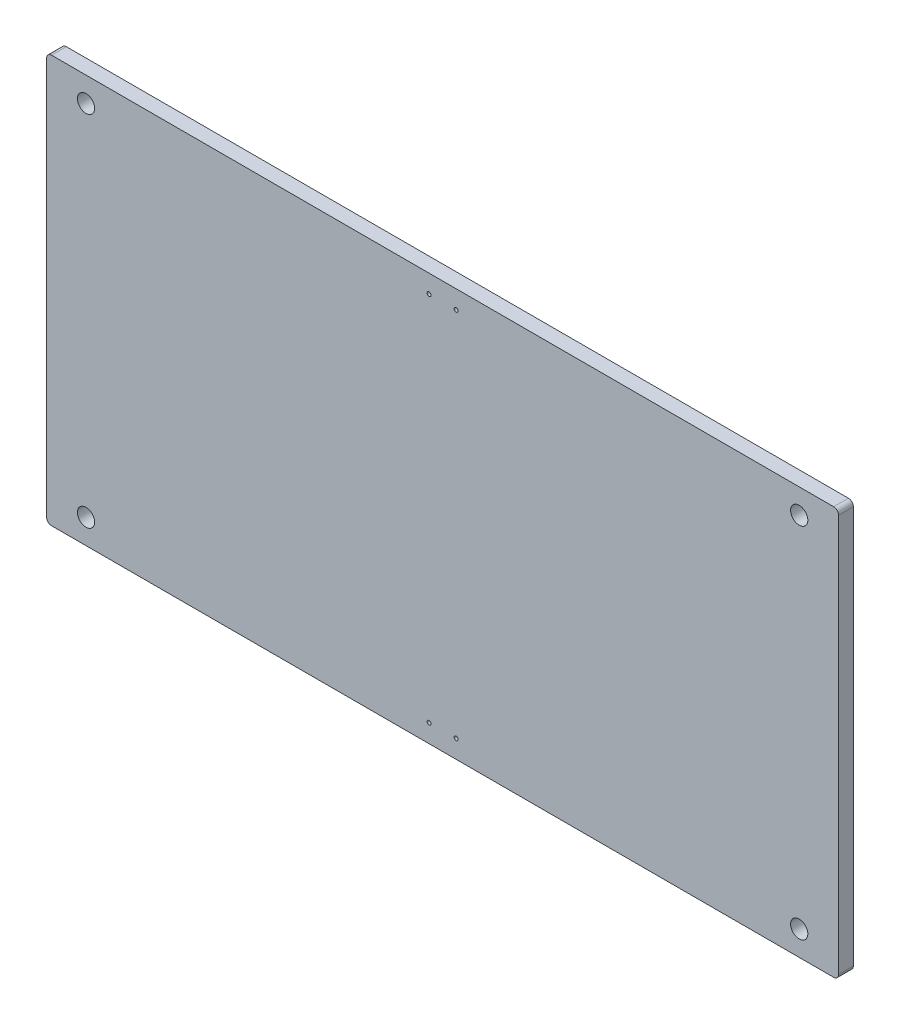
ISO-10303-21;
HEADER;
FILE_DESCRIPTION(('STEP AP214'),'2;1');
FILE_NAME('part.step','',(''),(''),'','','');
FILE_SCHEMA(('AUTOMOTIVE_DESIGN { 1 0 10303 214 1 1 1 1 }'));
ENDSEC;
DATA;
#1=APPLICATION_CONTEXT('core data for automotive mechanical design processes');
#2=APPLICATION_PROTOCOL_DEFINITION('international standard','automotive_design',2000,#1);
#3=PRODUCT_CONTEXT('',#1,'mechanical');
#4=PRODUCT('Part','Part','',(#3));
#5=PRODUCT_RELATED_PRODUCT_CATEGORY('part','',(#4));
#6=PRODUCT_DEFINITION_FORMATION('','',#4);
#7=PRODUCT_DEFINITION_CONTEXT('part definition',#1,'design');
#8=PRODUCT_DEFINITION('design','',#6,#7);
#9=PRODUCT_DEFINITION_SHAPE('','',#8);
#10=(LENGTH_UNIT() NAMED_UNIT(*) SI_UNIT(.MILLI.,.METRE.));
#11=(NAMED_UNIT(*) PLANE_ANGLE_UNIT() SI_UNIT($,.RADIAN.));
#12=(NAMED_UNIT(*) SI_UNIT($,.STERADIAN.) SOLID_ANGLE_UNIT());
#13=UNCERTAINTY_MEASURE_WITH_UNIT(LENGTH_MEASURE(1.E-05),#10,'distance_accuracy_value','');
#14=(GEOMETRIC_REPRESENTATION_CONTEXT(3) GLOBAL_UNCERTAINTY_ASSIGNED_CONTEXT((#13)) GLOBAL_UNIT_ASSIGNED_CONTEXT((#10,
#11,#12)) REPRESENTATION_CONTEXT('',''));
#15=CARTESIAN_POINT('',(0.,0.,0.));
#16=DIRECTION('',(0.,0.,1.));
#17=DIRECTION('',(1.,0.,0.));
#18=AXIS2_PLACEMENT_3D('',#15,#16,#17);
#19=CARTESIAN_POINT('',(431.087540983607,431.475409836066,6.));
#20=DIRECTION('',(1.,0.,0.));
#21=DIRECTION('',(0.,0.,-1.));
#22=AXIS2_PLACEMENT_3D('',#19,#20,#21);
#23=PLANE('',#22);
#24=DIRECTION('',(0.,-1.,0.));
#25=VECTOR('',#24,1.);
#26=CARTESIAN_POINT('',(431.087540983607,431.475409836066,0.));
#27=LINE('',#26,#25);
#28=CARTESIAN_POINT('',(431.087540983607,429.475409836066,0.));
#29=VERTEX_POINT('',#28);
#30=CARTESIAN_POINT('',(431.087540983607,267.865409836066,0.));
#31=VERTEX_POINT('',#30);
#32=EDGE_CURVE('E173',#29,#31,#27,.T.);
#33=ORIENTED_EDGE('',*,*,#32,.T.);
#34=DIRECTION('',(0.,0.,-1.));
#35=VECTOR('',#34,1.);
#36=CARTESIAN_POINT('',(431.087540983607,267.865409836066,6.));
#37=LINE('',#36,#35);
#38=CARTESIAN_POINT('',(431.087540983607,267.865409836066,6.));
#39=VERTEX_POINT('',#38);
#40=EDGE_CURVE('E11',#31,#39,#37,.F.);
#41=ORIENTED_EDGE('',*,*,#40,.T.);
#42=DIRECTION('',(0.,-1.,0.));
#43=VECTOR('',#42,1.);
#44=CARTESIAN_POINT('',(431.087540983607,431.475409836066,6.));
#45=LINE('',#44,#43);
#46=CARTESIAN_POINT('',(431.087540983607,429.475409836066,6.));
#47=VERTEX_POINT('',#46);
#48=EDGE_CURVE('E124',#47,#39,#45,.T.);
#49=ORIENTED_EDGE('',*,*,#48,.F.);
#50=DIRECTION('',(0.,0.,-1.));
#51=VECTOR('',#50,1.);
#52=CARTESIAN_POINT('',(431.087540983607,429.475409836066,6.));
#53=LINE('',#52,#51);
#54=EDGE_CURVE('E40',#47,#29,#53,.T.);
#55=ORIENTED_EDGE('',*,*,#54,.T.);
#56=EDGE_LOOP('',(#33,#41,#49,#55));
#57=FACE_BOUND('',#56,.T.);
#58=ADVANCED_FACE('F32',(#57),#23,.F.);
#59=CARTESIAN_POINT('',(431.087540983607,265.865409836066,6.));
#60=DIRECTION('',(0.,1.,0.));
#61=DIRECTION('',(0.,0.,1.));
#62=AXIS2_PLACEMENT_3D('',#59,#60,#61);
#63=PLANE('',#62);
#64=DIRECTION('',(1.,0.,0.));
#65=VECTOR('',#64,1.);
#66=CARTESIAN_POINT('',(431.087540983607,265.865409836066,0.));
#67=LINE('',#66,#65);
#68=CARTESIAN_POINT('',(433.087540983607,265.865409836066,0.));
#69=VERTEX_POINT('',#68);
#70=CARTESIAN_POINT('',(750.897540983607,265.865409836066,0.));
#71=VERTEX_POINT('',#70);
#72=EDGE_CURVE('E129',#69,#71,#67,.T.);
#73=ORIENTED_EDGE('',*,*,#72,.T.);
#74=DIRECTION('',(0.,0.,-1.));
#75=VECTOR('',#74,1.);
#76=CARTESIAN_POINT('',(750.897540983607,265.865409836066,6.));
#77=LINE('',#76,#75);
#78=CARTESIAN_POINT('',(750.897540983607,265.865409836066,6.));
#79=VERTEX_POINT('',#78);
#80=EDGE_CURVE('E47',#71,#79,#77,.F.);
#81=ORIENTED_EDGE('',*,*,#80,.T.);
#82=DIRECTION('',(1.,0.,0.));
#83=VECTOR('',#82,1.);
#84=CARTESIAN_POINT('',(431.087540983607,265.865409836066,6.));
#85=LINE('',#84,#83);
#86=CARTESIAN_POINT('',(433.087540983607,265.865409836066,6.));
#87=VERTEX_POINT('',#86);
#88=EDGE_CURVE('E127',#87,#79,#85,.T.);
#89=ORIENTED_EDGE('',*,*,#88,.F.);
#90=DIRECTION('',(0.,0.,-1.));
#91=VECTOR('',#90,1.);
#92=CARTESIAN_POINT('',(433.087540983607,265.865409836066,6.));
#93=LINE('',#92,#91);
#94=EDGE_CURVE('E165',#87,#69,#93,.T.);
#95=ORIENTED_EDGE('',*,*,#94,.T.);
#96=EDGE_LOOP('',(#73,#81,#89,#95));
#97=FACE_BOUND('',#96,.T.);
#98=ADVANCED_FACE('F244',(#97),#63,.F.);
#99=CARTESIAN_POINT('',(752.897540983607,431.475409836066,6.));
#100=DIRECTION('',(-1.,0.,0.));
#101=DIRECTION('',(0.,-1.,0.));
#102=AXIS2_PLACEMENT_3D('',#99,#100,#101);
#103=PLANE('',#102);
#104=DIRECTION('',(0.,1.,0.));
#105=VECTOR('',#104,1.);
#106=CARTESIAN_POINT('',(752.897540983607,431.475409836066,0.));
#107=LINE('',#106,#105);
#108=CARTESIAN_POINT('',(752.897540983607,267.865409836066,0.));
#109=VERTEX_POINT('',#108);
#110=CARTESIAN_POINT('',(752.897540983607,429.475409836066,0.));
#111=VERTEX_POINT('',#110);
#112=EDGE_CURVE('E125',#109,#111,#107,.T.);
#113=ORIENTED_EDGE('',*,*,#112,.T.);
#114=DIRECTION('',(0.,0.,-1.));
#115=VECTOR('',#114,1.);
#116=CARTESIAN_POINT('',(752.897540983607,429.475409836066,6.));
#117=LINE('',#116,#115);
#118=CARTESIAN_POINT('',(752.897540983607,429.475409836066,6.));
#119=VERTEX_POINT('',#118);
#120=EDGE_CURVE('E103',#111,#119,#117,.F.);
#121=ORIENTED_EDGE('',*,*,#120,.T.);
#122=DIRECTION('',(0.,1.,0.));
#123=VECTOR('',#122,1.);
#124=CARTESIAN_POINT('',(752.897540983607,431.475409836066,6.));
#125=LINE('',#124,#123);
#126=CARTESIAN_POINT('',(752.897540983607,267.865409836066,6.));
#127=VERTEX_POINT('',#126);
#128=EDGE_CURVE('E185',#127,#119,#125,.T.);
#129=ORIENTED_EDGE('',*,*,#128,.F.);
#130=DIRECTION('',(0.,0.,-1.));
#131=VECTOR('',#130,1.);
#132=CARTESIAN_POINT('',(752.897540983607,267.865409836066,6.));
#133=LINE('',#132,#131);
#134=EDGE_CURVE('E108',#127,#109,#133,.T.);
#135=ORIENTED_EDGE('',*,*,#134,.T.);
#136=EDGE_LOOP('',(#113,#121,#129,#135));
#137=FACE_BOUND('',#136,.T.);
#138=ADVANCED_FACE('F241',(#137),#103,.F.);
#139=CARTESIAN_POINT('',(431.087540983607,431.475409836066,6.));
#140=DIRECTION('',(0.,-1.,0.));
#141=DIRECTION('',(0.,0.,-1.));
#142=AXIS2_PLACEMENT_3D('',#139,#140,#141);
#143=PLANE('',#142);
#144=DIRECTION('',(-1.,0.,0.));
#145=VECTOR('',#144,1.);
#146=CARTESIAN_POINT('',(431.087540983607,431.475409836066,6.));
#147=LINE('',#146,#145);
#148=CARTESIAN_POINT('',(750.897540983607,431.475409836066,6.));
#149=VERTEX_POINT('',#148);
#150=CARTESIAN_POINT('',(433.087540983607,431.475409836066,6.));
#151=VERTEX_POINT('',#150);
#152=EDGE_CURVE('E118',#149,#151,#147,.T.);
#153=ORIENTED_EDGE('',*,*,#152,.F.);
#154=DIRECTION('',(0.,0.,-1.));
#155=VECTOR('',#154,1.);
#156=CARTESIAN_POINT('',(750.897540983607,431.475409836066,6.));
#157=LINE('',#156,#155);
#158=CARTESIAN_POINT('',(750.897540983607,431.475409836066,0.));
#159=VERTEX_POINT('',#158);
#160=EDGE_CURVE('E102',#149,#159,#157,.T.);
#161=ORIENTED_EDGE('',*,*,#160,.T.);
#162=DIRECTION('',(-1.,0.,0.));
#163=VECTOR('',#162,1.);
#164=CARTESIAN_POINT('',(431.087540983607,431.475409836066,0.));
#165=LINE('',#164,#163);
#166=CARTESIAN_POINT('',(433.087540983607,431.475409836066,0.));
#167=VERTEX_POINT('',#166);
#168=EDGE_CURVE('E115',#159,#167,#165,.T.);
#169=ORIENTED_EDGE('',*,*,#168,.T.);
#170=DIRECTION('',(0.,0.,-1.));
#171=VECTOR('',#170,1.);
#172=CARTESIAN_POINT('',(433.087540983607,431.475409836066,6.));
#173=LINE('',#172,#171);
#174=EDGE_CURVE('E120',#167,#151,#173,.F.);
#175=ORIENTED_EDGE('',*,*,#174,.T.);
#176=EDGE_LOOP('',(#153,#161,#169,#175));
#177=FACE_BOUND('',#176,.T.);
#178=ADVANCED_FACE('F114',(#177),#143,.F.);
#179=CARTESIAN_POINT('',(0.,0.,6.));
#180=DIRECTION('',(0.,0.,1.));
#181=DIRECTION('',(1.,0.,0.));
#182=AXIS2_PLACEMENT_3D('',#179,#180,#181);
#183=PLANE('',#182);
#184=CARTESIAN_POINT('',(597.492540983607,273.265409836066,6.));
#185=DIRECTION('',(0.,0.,1.));
#186=DIRECTION('',(1.,0.,0.));
#187=AXIS2_PLACEMENT_3D('',#184,#185,#186);
#188=CIRCLE('',#187,0.800000000000069);
#189=CARTESIAN_POINT('',(598.292540983607,273.265409836066,6.));
#190=VERTEX_POINT('',#189);
#191=EDGE_CURVE('E149',#190,#190,#188,.T.);
#192=ORIENTED_EDGE('',*,*,#191,.F.);
#193=EDGE_LOOP('',(#192));
#194=FACE_BOUND('',#193,.T.);
#195=CARTESIAN_POINT('',(586.492540983607,273.265409836066,6.));
#196=DIRECTION('',(0.,0.,1.));
#197=DIRECTION('',(1.,0.,0.));
#198=AXIS2_PLACEMENT_3D('',#195,#196,#197);
#199=CIRCLE('',#198,0.800000000000069);
#200=CARTESIAN_POINT('',(587.292540983607,273.265409836066,6.));
#201=VERTEX_POINT('',#200);
#202=EDGE_CURVE('E145',#201,#201,#199,.T.);
#203=ORIENTED_EDGE('',*,*,#202,.F.);
#204=EDGE_LOOP('',(#203));
#205=FACE_BOUND('',#204,.T.);
#206=CARTESIAN_POINT('',(597.492540983607,424.075409836066,6.));
#207=DIRECTION('',(0.,0.,1.));
#208=DIRECTION('',(1.,0.,0.));
#209=AXIS2_PLACEMENT_3D('',#206,#207,#208);
#210=CIRCLE('',#209,0.800000000000069);
#211=CARTESIAN_POINT('',(598.292540983607,424.075409836066,6.));
#212=VERTEX_POINT('',#211);
#213=EDGE_CURVE('E141',#212,#212,#210,.T.);
#214=ORIENTED_EDGE('',*,*,#213,.F.);
#215=EDGE_LOOP('',(#214));
#216=FACE_BOUND('',#215,.T.);
#217=CARTESIAN_POINT('',(586.492540983607,424.075409836066,6.));
#218=DIRECTION('',(0.,0.,1.));
#219=DIRECTION('',(1.,0.,0.));
#220=AXIS2_PLACEMENT_3D('',#217,#218,#219);
#221=CIRCLE('',#220,0.800000000000069);
#222=CARTESIAN_POINT('',(587.292540983607,424.075409836066,6.));
#223=VERTEX_POINT('',#222);
#224=EDGE_CURVE('E137',#223,#223,#221,.T.);
#225=ORIENTED_EDGE('',*,*,#224,.F.);
#226=EDGE_LOOP('',(#225));
#227=FACE_BOUND('',#226,.T.);
#228=CARTESIAN_POINT('',(447.087540983607,275.865409836066,6.));
#229=DIRECTION('',(0.,0.,1.));
#230=DIRECTION('',(1.,0.,0.));
#231=AXIS2_PLACEMENT_3D('',#228,#229,#230);
#232=CIRCLE('',#231,3.50000000000002);
#233=CARTESIAN_POINT('',(450.587540983607,275.865409836066,6.));
#234=VERTEX_POINT('',#233);
#235=EDGE_CURVE('E136',#234,#234,#232,.T.);
#236=ORIENTED_EDGE('',*,*,#235,.F.);
#237=EDGE_LOOP('',(#236));
#238=FACE_BOUND('',#237,.T.);
#239=CARTESIAN_POINT('',(736.897540983607,275.865409836066,6.));
#240=DIRECTION('',(0.,0.,1.));
#241=DIRECTION('',(1.,0.,0.));
#242=AXIS2_PLACEMENT_3D('',#239,#240,#241);
#243=CIRCLE('',#242,3.49999999999997);
#244=CARTESIAN_POINT('',(740.397540983607,275.865409836066,6.));
#245=VERTEX_POINT('',#244);
#246=EDGE_CURVE('E198',#245,#245,#243,.T.);
#247=ORIENTED_EDGE('',*,*,#246,.F.);
#248=EDGE_LOOP('',(#247));
#249=FACE_BOUND('',#248,.T.);
#250=CARTESIAN_POINT('',(736.897540983607,421.475409836066,6.));
#251=DIRECTION('',(0.,0.,1.));
#252=DIRECTION('',(1.,0.,0.));
#253=AXIS2_PLACEMENT_3D('',#250,#251,#252);
#254=CIRCLE('',#253,3.49999999999997);
#255=CARTESIAN_POINT('',(740.397540983607,421.475409836066,6.));
#256=VERTEX_POINT('',#255);
#257=EDGE_CURVE('E192',#256,#256,#254,.T.);
#258=ORIENTED_EDGE('',*,*,#257,.F.);
#259=EDGE_LOOP('',(#258));
#260=FACE_BOUND('',#259,.T.);
#261=CARTESIAN_POINT('',(447.087540983607,421.475409836066,6.));
#262=DIRECTION('',(0.,0.,1.));
#263=DIRECTION('',(1.,0.,0.));
#264=AXIS2_PLACEMENT_3D('',#261,#262,#263);
#265=CIRCLE('',#264,3.50000000000002);
#266=CARTESIAN_POINT('',(450.587540983607,421.475409836066,6.));
#267=VERTEX_POINT('',#266);
#268=EDGE_CURVE('E181',#267,#267,#265,.T.);
#269=ORIENTED_EDGE('',*,*,#268,.F.);
#270=EDGE_LOOP('',(#269));
#271=FACE_BOUND('',#270,.T.);
#272=ORIENTED_EDGE('',*,*,#128,.T.);
#273=CARTESIAN_POINT('',(750.897540983607,429.475409836066,6.));
#274=DIRECTION('',(0.,0.,1.));
#275=DIRECTION('',(1.,0.,0.));
#276=AXIS2_PLACEMENT_3D('',#273,#274,#275);
#277=CIRCLE('',#276,2.);
#278=EDGE_CURVE('E163',#119,#149,#277,.T.);
#279=ORIENTED_EDGE('',*,*,#278,.T.);
#280=ORIENTED_EDGE('',*,*,#152,.T.);
#281=CARTESIAN_POINT('',(433.087540983607,429.475409836066,6.));
#282=DIRECTION('',(0.,0.,1.));
#283=DIRECTION('',(1.,0.,0.));
#284=AXIS2_PLACEMENT_3D('',#281,#282,#283);
#285=CIRCLE('',#284,2.);
#286=EDGE_CURVE('E158',#151,#47,#285,.T.);
#287=ORIENTED_EDGE('',*,*,#286,.T.);
#288=ORIENTED_EDGE('',*,*,#48,.T.);
#289=CARTESIAN_POINT('',(433.087540983607,267.865409836066,6.));
#290=DIRECTION('',(0.,0.,1.));
#291=DIRECTION('',(1.,0.,0.));
#292=AXIS2_PLACEMENT_3D('',#289,#290,#291);
#293=CIRCLE('',#292,2.);
#294=EDGE_CURVE('E54',#39,#87,#293,.T.);
#295=ORIENTED_EDGE('',*,*,#294,.T.);
#296=ORIENTED_EDGE('',*,*,#88,.T.);
#297=CARTESIAN_POINT('',(750.897540983607,267.865409836066,6.));
#298=DIRECTION('',(0.,0.,1.));
#299=DIRECTION('',(1.,0.,0.));
#300=AXIS2_PLACEMENT_3D('',#297,#298,#299);
#301=CIRCLE('',#300,2.);
#302=EDGE_CURVE('E161',#79,#127,#301,.T.);
#303=ORIENTED_EDGE('',*,*,#302,.T.);
#304=EDGE_LOOP('',(#272,#279,#280,#287,#288,#295,#296,#303));
#305=FACE_BOUND('',#304,.T.);
#306=ADVANCED_FACE('F220',(#194,#205,#216,#227,#238,#249,#260,#271,#305),#183,.T.);
#307=CARTESIAN_POINT('',(0.,0.,0.));
#308=DIRECTION('',(0.,0.,1.));
#309=DIRECTION('',(1.,0.,0.));
#310=AXIS2_PLACEMENT_3D('',#307,#308,#309);
#311=PLANE('',#310);
#312=CARTESIAN_POINT('',(597.492540983607,273.265409836066,0.));
#313=DIRECTION('',(0.,0.,1.));
#314=DIRECTION('',(1.,0.,0.));
#315=AXIS2_PLACEMENT_3D('',#312,#313,#314);
#316=CIRCLE('',#315,0.800000000000069);
#317=CARTESIAN_POINT('',(598.292540983607,273.265409836066,0.));
#318=VERTEX_POINT('',#317);
#319=EDGE_CURVE('E146',#318,#318,#316,.T.);
#320=ORIENTED_EDGE('',*,*,#319,.T.);
#321=EDGE_LOOP('',(#320));
#322=FACE_BOUND('',#321,.T.);
#323=CARTESIAN_POINT('',(586.492540983607,273.265409836066,0.));
#324=DIRECTION('',(0.,0.,1.));
#325=DIRECTION('',(1.,0.,0.));
#326=AXIS2_PLACEMENT_3D('',#323,#324,#325);
#327=CIRCLE('',#326,0.800000000000069);
#328=CARTESIAN_POINT('',(587.292540983607,273.265409836066,0.));
#329=VERTEX_POINT('',#328);
#330=EDGE_CURVE('E142',#329,#329,#327,.T.);
#331=ORIENTED_EDGE('',*,*,#330,.T.);
#332=EDGE_LOOP('',(#331));
#333=FACE_BOUND('',#332,.T.);
#334=CARTESIAN_POINT('',(597.492540983607,424.075409836066,0.));
#335=DIRECTION('',(0.,0.,1.));
#336=DIRECTION('',(1.,0.,0.));
#337=AXIS2_PLACEMENT_3D('',#334,#335,#336);
#338=CIRCLE('',#337,0.800000000000069);
#339=CARTESIAN_POINT('',(598.292540983607,424.075409836066,0.));
#340=VERTEX_POINT('',#339);
#341=EDGE_CURVE('E138',#340,#340,#338,.T.);
#342=ORIENTED_EDGE('',*,*,#341,.T.);
#343=EDGE_LOOP('',(#342));
#344=FACE_BOUND('',#343,.T.);
#345=CARTESIAN_POINT('',(586.492540983607,424.075409836066,0.));
#346=DIRECTION('',(0.,0.,1.));
#347=DIRECTION('',(1.,0.,0.));
#348=AXIS2_PLACEMENT_3D('',#345,#346,#347);
#349=CIRCLE('',#348,0.800000000000069);
#350=CARTESIAN_POINT('',(587.292540983607,424.075409836066,0.));
#351=VERTEX_POINT('',#350);
#352=EDGE_CURVE('E133',#351,#351,#349,.T.);
#353=ORIENTED_EDGE('',*,*,#352,.T.);
#354=EDGE_LOOP('',(#353));
#355=FACE_BOUND('',#354,.T.);
#356=CARTESIAN_POINT('',(447.087540983607,275.865409836066,0.));
#357=DIRECTION('',(0.,0.,1.));
#358=DIRECTION('',(1.,0.,0.));
#359=AXIS2_PLACEMENT_3D('',#356,#357,#358);
#360=CIRCLE('',#359,3.50000000000002);
#361=CARTESIAN_POINT('',(450.587540983607,275.865409836066,0.));
#362=VERTEX_POINT('',#361);
#363=EDGE_CURVE('E201',#362,#362,#360,.T.);
#364=ORIENTED_EDGE('',*,*,#363,.T.);
#365=EDGE_LOOP('',(#364));
#366=FACE_BOUND('',#365,.T.);
#367=CARTESIAN_POINT('',(736.897540983607,275.865409836066,0.));
#368=DIRECTION('',(0.,0.,1.));
#369=DIRECTION('',(1.,0.,0.));
#370=AXIS2_PLACEMENT_3D('',#367,#368,#369);
#371=CIRCLE('',#370,3.49999999999997);
#372=CARTESIAN_POINT('',(740.397540983607,275.865409836066,0.));
#373=VERTEX_POINT('',#372);
#374=EDGE_CURVE('E195',#373,#373,#371,.T.);
#375=ORIENTED_EDGE('',*,*,#374,.T.);
#376=EDGE_LOOP('',(#375));
#377=FACE_BOUND('',#376,.T.);
#378=CARTESIAN_POINT('',(736.897540983607,421.475409836066,0.));
#379=DIRECTION('',(0.,0.,1.));
#380=DIRECTION('',(1.,0.,0.));
#381=AXIS2_PLACEMENT_3D('',#378,#379,#380);
#382=CIRCLE('',#381,3.49999999999997);
#383=CARTESIAN_POINT('',(740.397540983607,421.475409836066,0.));
#384=VERTEX_POINT('',#383);
#385=EDGE_CURVE('E190',#384,#384,#382,.T.);
#386=ORIENTED_EDGE('',*,*,#385,.T.);
#387=EDGE_LOOP('',(#386));
#388=FACE_BOUND('',#387,.T.);
#389=CARTESIAN_POINT('',(447.087540983607,421.475409836066,0.));
#390=DIRECTION('',(0.,0.,1.));
#391=DIRECTION('',(1.,0.,0.));
#392=AXIS2_PLACEMENT_3D('',#389,#390,#391);
#393=CIRCLE('',#392,3.50000000000002);
#394=CARTESIAN_POINT('',(450.587540983607,421.475409836066,0.));
#395=VERTEX_POINT('',#394);
#396=EDGE_CURVE('E178',#395,#395,#393,.T.);
#397=ORIENTED_EDGE('',*,*,#396,.T.);
#398=EDGE_LOOP('',(#397));
#399=FACE_BOUND('',#398,.T.);
#400=ORIENTED_EDGE('',*,*,#168,.F.);
#401=CARTESIAN_POINT('',(750.897540983607,429.475409836066,0.));
#402=DIRECTION('',(0.,0.,1.));
#403=DIRECTION('',(1.,0.,0.));
#404=AXIS2_PLACEMENT_3D('',#401,#402,#403);
#405=CIRCLE('',#404,2.);
#406=EDGE_CURVE('E98',#159,#111,#405,.F.);
#407=ORIENTED_EDGE('',*,*,#406,.T.);
#408=ORIENTED_EDGE('',*,*,#112,.F.);
#409=CARTESIAN_POINT('',(750.897540983607,267.865409836066,0.));
#410=DIRECTION('',(0.,0.,1.));
#411=DIRECTION('',(1.,0.,0.));
#412=AXIS2_PLACEMENT_3D('',#409,#410,#411);
#413=CIRCLE('',#412,2.);
#414=EDGE_CURVE('E109',#109,#71,#413,.F.);
#415=ORIENTED_EDGE('',*,*,#414,.T.);
#416=ORIENTED_EDGE('',*,*,#72,.F.);
#417=CARTESIAN_POINT('',(433.087540983607,267.865409836066,0.));
#418=DIRECTION('',(0.,0.,1.));
#419=DIRECTION('',(1.,0.,0.));
#420=AXIS2_PLACEMENT_3D('',#417,#418,#419);
#421=CIRCLE('',#420,2.);
#422=EDGE_CURVE('E152',#69,#31,#421,.F.);
#423=ORIENTED_EDGE('',*,*,#422,.T.);
#424=ORIENTED_EDGE('',*,*,#32,.F.);
#425=CARTESIAN_POINT('',(433.087540983607,429.475409836066,0.));
#426=DIRECTION('',(0.,0.,1.));
#427=DIRECTION('',(1.,0.,0.));
#428=AXIS2_PLACEMENT_3D('',#425,#426,#427);
#429=CIRCLE('',#428,2.);
#430=EDGE_CURVE('E119',#29,#167,#429,.F.);
#431=ORIENTED_EDGE('',*,*,#430,.T.);
#432=EDGE_LOOP('',(#400,#407,#408,#415,#416,#423,#424,#431));
#433=FACE_BOUND('',#432,.T.);
#434=ADVANCED_FACE('F122',(#322,#333,#344,#355,#366,#377,#388,#399,#433),#311,.F.);
#435=CARTESIAN_POINT('',(447.087540983607,421.475409836066,0.));
#436=DIRECTION('',(0.,0.,1.));
#437=DIRECTION('',(1.,0.,0.));
#438=AXIS2_PLACEMENT_3D('',#435,#436,#437);
#439=CYLINDRICAL_SURFACE('',#438,3.50000000000002);
#440=ORIENTED_EDGE('',*,*,#396,.F.);
#441=EDGE_LOOP('',(#440));
#442=FACE_BOUND('',#441,.T.);
#443=ORIENTED_EDGE('',*,*,#268,.T.);
#444=EDGE_LOOP('',(#443));
#445=FACE_BOUND('',#444,.T.);
#446=ADVANCED_FACE('F345',(#442,#445),#439,.F.);
#447=CARTESIAN_POINT('',(736.897540983607,421.475409836066,0.));
#448=DIRECTION('',(0.,0.,1.));
#449=DIRECTION('',(1.,0.,0.));
#450=AXIS2_PLACEMENT_3D('',#447,#448,#449);
#451=CYLINDRICAL_SURFACE('',#450,3.49999999999997);
#452=ORIENTED_EDGE('',*,*,#385,.F.);
#453=EDGE_LOOP('',(#452));
#454=FACE_BOUND('',#453,.T.);
#455=ORIENTED_EDGE('',*,*,#257,.T.);
#456=EDGE_LOOP('',(#455));
#457=FACE_BOUND('',#456,.T.);
#458=ADVANCED_FACE('F336',(#454,#457),#451,.F.);
#459=CARTESIAN_POINT('',(736.897540983607,275.865409836066,0.));
#460=DIRECTION('',(0.,0.,1.));
#461=DIRECTION('',(1.,0.,0.));
#462=AXIS2_PLACEMENT_3D('',#459,#460,#461);
#463=CYLINDRICAL_SURFACE('',#462,3.49999999999997);
#464=ORIENTED_EDGE('',*,*,#374,.F.);
#465=EDGE_LOOP('',(#464));
#466=FACE_BOUND('',#465,.T.);
#467=ORIENTED_EDGE('',*,*,#246,.T.);
#468=EDGE_LOOP('',(#467));
#469=FACE_BOUND('',#468,.T.);
#470=ADVANCED_FACE('F327',(#466,#469),#463,.F.);
#471=CARTESIAN_POINT('',(447.087540983607,275.865409836066,0.));
#472=DIRECTION('',(0.,0.,1.));
#473=DIRECTION('',(1.,0.,0.));
#474=AXIS2_PLACEMENT_3D('',#471,#472,#473);
#475=CYLINDRICAL_SURFACE('',#474,3.50000000000002);
#476=ORIENTED_EDGE('',*,*,#363,.F.);
#477=EDGE_LOOP('',(#476));
#478=FACE_BOUND('',#477,.T.);
#479=ORIENTED_EDGE('',*,*,#235,.T.);
#480=EDGE_LOOP('',(#479));
#481=FACE_BOUND('',#480,.T.);
#482=ADVANCED_FACE('F318',(#478,#481),#475,.F.);
#483=CARTESIAN_POINT('',(586.492540983607,424.075409836066,-4.));
#484=DIRECTION('',(0.,0.,1.));
#485=DIRECTION('',(1.,0.,0.));
#486=AXIS2_PLACEMENT_3D('',#483,#484,#485);
#487=CYLINDRICAL_SURFACE('',#486,0.800000000000069);
#488=ORIENTED_EDGE('',*,*,#224,.T.);
#489=EDGE_LOOP('',(#488));
#490=FACE_BOUND('',#489,.T.);
#491=ORIENTED_EDGE('',*,*,#352,.F.);
#492=EDGE_LOOP('',(#491));
#493=FACE_BOUND('',#492,.T.);
#494=ADVANCED_FACE('F309',(#490,#493),#487,.F.);
#495=CARTESIAN_POINT('',(597.492540983607,424.075409836066,-4.));
#496=DIRECTION('',(0.,0.,1.));
#497=DIRECTION('',(1.,0.,0.));
#498=AXIS2_PLACEMENT_3D('',#495,#496,#497);
#499=CYLINDRICAL_SURFACE('',#498,0.800000000000069);
#500=ORIENTED_EDGE('',*,*,#213,.T.);
#501=EDGE_LOOP('',(#500));
#502=FACE_BOUND('',#501,.T.);
#503=ORIENTED_EDGE('',*,*,#341,.F.);
#504=EDGE_LOOP('',(#503));
#505=FACE_BOUND('',#504,.T.);
#506=ADVANCED_FACE('F300',(#502,#505),#499,.F.);
#507=CARTESIAN_POINT('',(586.492540983607,273.265409836066,-4.));
#508=DIRECTION('',(0.,0.,1.));
#509=DIRECTION('',(1.,0.,0.));
#510=AXIS2_PLACEMENT_3D('',#507,#508,#509);
#511=CYLINDRICAL_SURFACE('',#510,0.800000000000069);
#512=ORIENTED_EDGE('',*,*,#202,.T.);
#513=EDGE_LOOP('',(#512));
#514=FACE_BOUND('',#513,.T.);
#515=ORIENTED_EDGE('',*,*,#330,.F.);
#516=EDGE_LOOP('',(#515));
#517=FACE_BOUND('',#516,.T.);
#518=ADVANCED_FACE('F292',(#514,#517),#511,.F.);
#519=CARTESIAN_POINT('',(597.492540983607,273.265409836066,-4.));
#520=DIRECTION('',(0.,0.,1.));
#521=DIRECTION('',(1.,0.,0.));
#522=AXIS2_PLACEMENT_3D('',#519,#520,#521);
#523=CYLINDRICAL_SURFACE('',#522,0.800000000000069);
#524=ORIENTED_EDGE('',*,*,#191,.T.);
#525=EDGE_LOOP('',(#524));
#526=FACE_BOUND('',#525,.T.);
#527=ORIENTED_EDGE('',*,*,#319,.F.);
#528=EDGE_LOOP('',(#527));
#529=FACE_BOUND('',#528,.T.);
#530=ADVANCED_FACE('F217',(#526,#529),#523,.F.);
#531=CARTESIAN_POINT('',(750.897540983607,429.475409836066,6.));
#532=DIRECTION('',(0.,0.,-1.));
#533=DIRECTION('',(-1.,0.,0.));
#534=AXIS2_PLACEMENT_3D('',#531,#532,#533);
#535=CYLINDRICAL_SURFACE('',#534,2.);
#536=ORIENTED_EDGE('',*,*,#278,.F.);
#537=ORIENTED_EDGE('',*,*,#120,.F.);
#538=ORIENTED_EDGE('',*,*,#406,.F.);
#539=ORIENTED_EDGE('',*,*,#160,.F.);
#540=EDGE_LOOP('',(#536,#537,#538,#539));
#541=FACE_BOUND('',#540,.T.);
#542=ADVANCED_FACE('F101',(#541),#535,.T.);
#543=CARTESIAN_POINT('',(750.897540983607,267.865409836066,6.));
#544=DIRECTION('',(0.,0.,-1.));
#545=DIRECTION('',(-1.,0.,0.));
#546=AXIS2_PLACEMENT_3D('',#543,#544,#545);
#547=CYLINDRICAL_SURFACE('',#546,2.);
#548=ORIENTED_EDGE('',*,*,#302,.F.);
#549=ORIENTED_EDGE('',*,*,#80,.F.);
#550=ORIENTED_EDGE('',*,*,#414,.F.);
#551=ORIENTED_EDGE('',*,*,#134,.F.);
#552=EDGE_LOOP('',(#548,#549,#550,#551));
#553=FACE_BOUND('',#552,.T.);
#554=ADVANCED_FACE('F243',(#553),#547,.T.);
#555=CARTESIAN_POINT('',(433.087540983607,267.865409836066,6.));
#556=DIRECTION('',(0.,0.,-1.));
#557=DIRECTION('',(-1.,0.,0.));
#558=AXIS2_PLACEMENT_3D('',#555,#556,#557);
#559=CYLINDRICAL_SURFACE('',#558,2.);
#560=ORIENTED_EDGE('',*,*,#294,.F.);
#561=ORIENTED_EDGE('',*,*,#40,.F.);
#562=ORIENTED_EDGE('',*,*,#422,.F.);
#563=ORIENTED_EDGE('',*,*,#94,.F.);
#564=EDGE_LOOP('',(#560,#561,#562,#563));
#565=FACE_BOUND('',#564,.T.);
#566=ADVANCED_FACE('F247',(#565),#559,.T.);
#567=CARTESIAN_POINT('',(433.087540983607,429.475409836066,6.));
#568=DIRECTION('',(0.,0.,-1.));
#569=DIRECTION('',(-1.,0.,0.));
#570=AXIS2_PLACEMENT_3D('',#567,#568,#569);
#571=CYLINDRICAL_SURFACE('',#570,2.);
#572=ORIENTED_EDGE('',*,*,#286,.F.);
#573=ORIENTED_EDGE('',*,*,#174,.F.);
#574=ORIENTED_EDGE('',*,*,#430,.F.);
#575=ORIENTED_EDGE('',*,*,#54,.F.);
#576=EDGE_LOOP('',(#572,#573,#574,#575));
#577=FACE_BOUND('',#576,.T.);
#578=ADVANCED_FACE('F34',(#577),#571,.T.);
#579=CLOSED_SHELL('',(#58,#98,#138,#178,#306,#434,#446,#458,#470,#482,#494,#506,#518,#530,#542,
#554,#566,#578));
#580=MANIFOLD_SOLID_BREP('B2',#579);
#581=ADVANCED_BREP_SHAPE_REPRESENTATION('',(#18,#580),#14);
#582=SHAPE_DEFINITION_REPRESENTATION(#9,#581);
ENDSEC;
END-ISO-10303-21;
